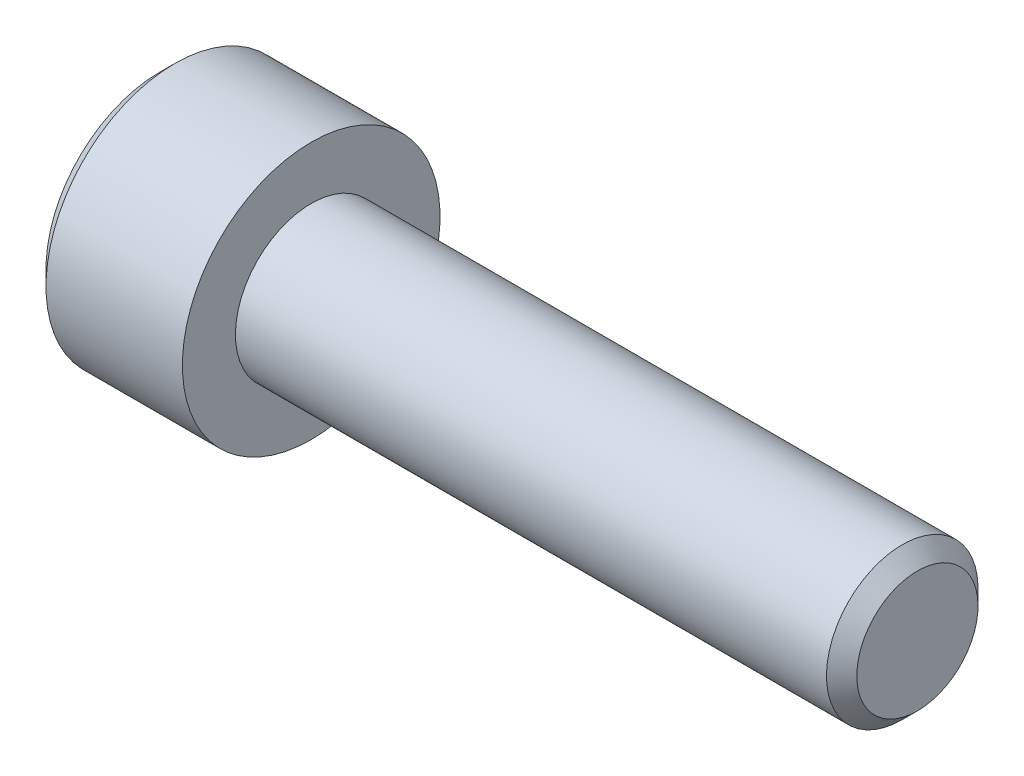
ISO-10303-21;
HEADER;
FILE_DESCRIPTION(('STEP AP214'),'2;1');
FILE_NAME('part.step','',(''),(''),'','','');
FILE_SCHEMA(('AUTOMOTIVE_DESIGN { 1 0 10303 214 1 1 1 1 }'));
ENDSEC;
DATA;
#1=APPLICATION_CONTEXT('core data for automotive mechanical design processes');
#2=APPLICATION_PROTOCOL_DEFINITION('international standard','automotive_design',2000,#1);
#3=PRODUCT_CONTEXT('',#1,'mechanical');
#4=PRODUCT('Part','Part','',(#3));
#5=PRODUCT_RELATED_PRODUCT_CATEGORY('part','',(#4));
#6=PRODUCT_DEFINITION_FORMATION('','',#4);
#7=PRODUCT_DEFINITION_CONTEXT('part definition',#1,'design');
#8=PRODUCT_DEFINITION('design','',#6,#7);
#9=PRODUCT_DEFINITION_SHAPE('','',#8);
#10=(LENGTH_UNIT() NAMED_UNIT(*) SI_UNIT(.MILLI.,.METRE.));
#11=(NAMED_UNIT(*) PLANE_ANGLE_UNIT() SI_UNIT($,.RADIAN.));
#12=(NAMED_UNIT(*) SI_UNIT($,.STERADIAN.) SOLID_ANGLE_UNIT());
#13=UNCERTAINTY_MEASURE_WITH_UNIT(LENGTH_MEASURE(1.E-05),#10,'distance_accuracy_value','');
#14=(GEOMETRIC_REPRESENTATION_CONTEXT(3) GLOBAL_UNCERTAINTY_ASSIGNED_CONTEXT((#13)) GLOBAL_UNIT_ASSIGNED_CONTEXT((#10,
#11,#12)) REPRESENTATION_CONTEXT('',''));
#15=CARTESIAN_POINT('',(0.,0.,0.));
#16=DIRECTION('',(0.,0.,1.));
#17=DIRECTION('',(1.,0.,0.));
#18=AXIS2_PLACEMENT_3D('',#15,#16,#17);
#19=CARTESIAN_POINT('',(-5.,0.,0.));
#20=DIRECTION('',(1.,0.,0.));
#21=DIRECTION('',(0.,1.,0.));
#22=AXIS2_PLACEMENT_3D('',#19,#20,#21);
#23=PLANE('',#22);
#24=CARTESIAN_POINT('',(-5.,0.,0.));
#25=DIRECTION('',(-1.,0.,0.));
#26=DIRECTION('',(0.,-1.,0.));
#27=AXIS2_PLACEMENT_3D('',#24,#25,#26);
#28=CIRCLE('',#27,3.75);
#29=CARTESIAN_POINT('',(-5.,-3.75,0.));
#30=VERTEX_POINT('',#29);
#31=EDGE_CURVE('E158',#30,#30,#28,.T.);
#32=ORIENTED_EDGE('',*,*,#31,.T.);
#33=EDGE_LOOP('',(#32));
#34=FACE_BOUND('',#33,.T.);
#35=DIRECTION('',(0.,-0.499999999999983,-0.866025403784448));
#36=VECTOR('',#35,1.);
#37=CARTESIAN_POINT('',(-5.,-1.1547005383793,2.));
#38=LINE('',#37,#36);
#39=CARTESIAN_POINT('',(-5.,-1.1547005383793,2.));
#40=VERTEX_POINT('',#39);
#41=CARTESIAN_POINT('',(-5.,-2.3094010767585,0.));
#42=VERTEX_POINT('',#41);
#43=EDGE_CURVE('E274',#40,#42,#38,.T.);
#44=ORIENTED_EDGE('',*,*,#43,.T.);
#45=DIRECTION('',(0.,0.499999999999983,-0.866025403784448));
#46=VECTOR('',#45,1.);
#47=CARTESIAN_POINT('',(-5.,-2.3094010767585,0.));
#48=LINE('',#47,#46);
#49=CARTESIAN_POINT('',(-5.,-1.1547005383793,-2.));
#50=VERTEX_POINT('',#49);
#51=EDGE_CURVE('E276',#42,#50,#48,.T.);
#52=ORIENTED_EDGE('',*,*,#51,.T.);
#53=DIRECTION('',(0.,1.,0.));
#54=VECTOR('',#53,1.);
#55=CARTESIAN_POINT('',(-5.,-1.1547005383793,-2.));
#56=LINE('',#55,#54);
#57=CARTESIAN_POINT('',(-5.,1.1547005383793,-2.));
#58=VERTEX_POINT('',#57);
#59=EDGE_CURVE('E278',#50,#58,#56,.T.);
#60=ORIENTED_EDGE('',*,*,#59,.T.);
#61=DIRECTION('',(0.,0.499999999999983,0.866025403784448));
#62=VECTOR('',#61,1.);
#63=CARTESIAN_POINT('',(-5.,1.1547005383793,-2.));
#64=LINE('',#63,#62);
#65=CARTESIAN_POINT('',(-5.,2.3094010767585,0.));
#66=VERTEX_POINT('',#65);
#67=EDGE_CURVE('E123',#58,#66,#64,.T.);
#68=ORIENTED_EDGE('',*,*,#67,.T.);
#69=DIRECTION('',(0.,-0.499999999999983,0.866025403784448));
#70=VECTOR('',#69,1.);
#71=CARTESIAN_POINT('',(-5.,2.3094010767585,0.));
#72=LINE('',#71,#70);
#73=CARTESIAN_POINT('',(-5.,1.1547005383793,2.));
#74=VERTEX_POINT('',#73);
#75=EDGE_CURVE('E271',#66,#74,#72,.T.);
#76=ORIENTED_EDGE('',*,*,#75,.T.);
#77=DIRECTION('',(0.,-1.,0.));
#78=VECTOR('',#77,1.);
#79=CARTESIAN_POINT('',(-5.,1.1547005383793,2.));
#80=LINE('',#79,#78);
#81=EDGE_CURVE('E138',#74,#40,#80,.T.);
#82=ORIENTED_EDGE('',*,*,#81,.T.);
#83=EDGE_LOOP('',(#44,#52,#60,#68,#76,#82));
#84=FACE_BOUND('',#83,.T.);
#85=ADVANCED_FACE('F39',(#34,#84),#23,.F.);
#86=CARTESIAN_POINT('',(-4.5,0.,0.));
#87=DIRECTION('',(1.,0.,0.));
#88=DIRECTION('',(0.,1.,0.));
#89=AXIS2_PLACEMENT_3D('',#86,#87,#88);
#90=CONICAL_SURFACE('',#89,4.25,0.785398163397448);
#91=ORIENTED_EDGE('',*,*,#31,.F.);
#92=EDGE_LOOP('',(#91));
#93=FACE_BOUND('',#92,.T.);
#94=CARTESIAN_POINT('',(-4.5,0.,0.));
#95=DIRECTION('',(-1.,0.,0.));
#96=DIRECTION('',(0.,-1.,0.));
#97=AXIS2_PLACEMENT_3D('',#94,#95,#96);
#98=CIRCLE('',#97,4.25);
#99=CARTESIAN_POINT('',(-4.5,-4.25,0.));
#100=VERTEX_POINT('',#99);
#101=EDGE_CURVE('E155',#100,#100,#98,.T.);
#102=ORIENTED_EDGE('',*,*,#101,.T.);
#103=EDGE_LOOP('',(#102));
#104=FACE_BOUND('',#103,.T.);
#105=ADVANCED_FACE('F178',(#93,#104),#90,.T.);
#106=CARTESIAN_POINT('',(20.,0.,0.));
#107=DIRECTION('',(-1.,0.,0.));
#108=DIRECTION('',(0.,-1.,0.));
#109=AXIS2_PLACEMENT_3D('',#106,#107,#108);
#110=CYLINDRICAL_SURFACE('',#109,4.25);
#111=ORIENTED_EDGE('',*,*,#101,.F.);
#112=EDGE_LOOP('',(#111));
#113=FACE_BOUND('',#112,.T.);
#114=CARTESIAN_POINT('',(0.,0.,0.));
#115=DIRECTION('',(-1.,0.,0.));
#116=DIRECTION('',(0.,-1.,0.));
#117=AXIS2_PLACEMENT_3D('',#114,#115,#116);
#118=CIRCLE('',#117,4.25);
#119=CARTESIAN_POINT('',(0.,-4.25,0.));
#120=VERTEX_POINT('',#119);
#121=EDGE_CURVE('E152',#120,#120,#118,.T.);
#122=ORIENTED_EDGE('',*,*,#121,.T.);
#123=EDGE_LOOP('',(#122));
#124=FACE_BOUND('',#123,.T.);
#125=ADVANCED_FACE('F183',(#113,#124),#110,.T.);
#126=CARTESIAN_POINT('',(0.,4.25,0.));
#127=DIRECTION('',(-1.,0.,0.));
#128=DIRECTION('',(0.,-1.,0.));
#129=AXIS2_PLACEMENT_3D('',#126,#127,#128);
#130=PLANE('',#129);
#131=ORIENTED_EDGE('',*,*,#121,.F.);
#132=EDGE_LOOP('',(#131));
#133=FACE_BOUND('',#132,.T.);
#134=CARTESIAN_POINT('',(0.,0.,0.));
#135=DIRECTION('',(-1.,0.,0.));
#136=DIRECTION('',(0.,-1.,0.));
#137=AXIS2_PLACEMENT_3D('',#134,#135,#136);
#138=CIRCLE('',#137,2.5);
#139=CARTESIAN_POINT('',(0.,-2.5,0.));
#140=VERTEX_POINT('',#139);
#141=EDGE_CURVE('E148',#140,#140,#138,.T.);
#142=ORIENTED_EDGE('',*,*,#141,.T.);
#143=EDGE_LOOP('',(#142));
#144=FACE_BOUND('',#143,.T.);
#145=ADVANCED_FACE('F190',(#133,#144),#130,.F.);
#146=CARTESIAN_POINT('',(20.,0.,0.));
#147=DIRECTION('',(-1.,0.,0.));
#148=DIRECTION('',(0.,-1.,0.));
#149=AXIS2_PLACEMENT_3D('',#146,#147,#148);
#150=CYLINDRICAL_SURFACE('',#149,2.5);
#151=CARTESIAN_POINT('',(19.5,0.,0.));
#152=DIRECTION('',(-1.,0.,0.));
#153=DIRECTION('',(0.,-1.,0.));
#154=AXIS2_PLACEMENT_3D('',#151,#152,#153);
#155=CIRCLE('',#154,2.5);
#156=CARTESIAN_POINT('',(19.5,-2.5,0.));
#157=VERTEX_POINT('',#156);
#158=EDGE_CURVE('E47',#157,#157,#155,.T.);
#159=ORIENTED_EDGE('',*,*,#158,.T.);
#160=EDGE_LOOP('',(#159));
#161=FACE_BOUND('',#160,.T.);
#162=ORIENTED_EDGE('',*,*,#141,.F.);
#163=EDGE_LOOP('',(#162));
#164=FACE_BOUND('',#163,.T.);
#165=ADVANCED_FACE('F163',(#161,#164),#150,.T.);
#166=CARTESIAN_POINT('',(20.,2.5,0.));
#167=DIRECTION('',(-1.,0.,0.));
#168=DIRECTION('',(0.,-1.,0.));
#169=AXIS2_PLACEMENT_3D('',#166,#167,#168);
#170=PLANE('',#169);
#171=CARTESIAN_POINT('',(20.,0.,0.));
#172=DIRECTION('',(-1.,0.,0.));
#173=DIRECTION('',(0.,-1.,0.));
#174=AXIS2_PLACEMENT_3D('',#171,#172,#173);
#175=CIRCLE('',#174,1.99999999999999);
#176=CARTESIAN_POINT('',(20.,-1.99999999999999,0.));
#177=VERTEX_POINT('',#176);
#178=EDGE_CURVE('E11',#177,#177,#175,.F.);
#179=ORIENTED_EDGE('',*,*,#178,.T.);
#180=EDGE_LOOP('',(#179));
#181=FACE_BOUND('',#180,.T.);
#182=ADVANCED_FACE('F167',(#181),#170,.F.);
#183=CARTESIAN_POINT('',(19.5,0.,0.));
#184=DIRECTION('',(-1.,0.,0.));
#185=DIRECTION('',(0.,-1.,0.));
#186=AXIS2_PLACEMENT_3D('',#183,#184,#185);
#187=CONICAL_SURFACE('',#186,2.5,0.785398163397455);
#188=ORIENTED_EDGE('',*,*,#178,.F.);
#189=EDGE_LOOP('',(#188));
#190=FACE_BOUND('',#189,.T.);
#191=ORIENTED_EDGE('',*,*,#158,.F.);
#192=EDGE_LOOP('',(#191));
#193=FACE_BOUND('',#192,.T.);
#194=ADVANCED_FACE('F41',(#190,#193),#187,.T.);
#195=CARTESIAN_POINT('',(-2.5,2.3094010767585,0.));
#196=DIRECTION('',(0.,-0.866025403784448,-0.499999999999983));
#197=DIRECTION('',(0.,0.499999999999983,-0.866025403784448));
#198=AXIS2_PLACEMENT_3D('',#195,#196,#197);
#199=PLANE('',#198);
#200=DIRECTION('',(0.,-0.499999999999983,0.866025403784448));
#201=VECTOR('',#200,1.);
#202=CARTESIAN_POINT('',(-2.5,2.3094010767585,0.));
#203=LINE('',#202,#201);
#204=CARTESIAN_POINT('',(-2.5,2.3094010767585,0.));
#205=VERTEX_POINT('',#204);
#206=CARTESIAN_POINT('',(-2.5,1.73205080756891,0.999999999999976));
#207=VERTEX_POINT('',#206);
#208=EDGE_CURVE('E120',#205,#207,#203,.T.);
#209=ORIENTED_EDGE('',*,*,#208,.T.);
#210=CARTESIAN_POINT('',(-2.5,1.1547005383793,2.));
#211=VERTEX_POINT('',#210);
#212=EDGE_CURVE('E112',#207,#211,#203,.T.);
#213=ORIENTED_EDGE('',*,*,#212,.T.);
#214=DIRECTION('',(-1.,0.,0.));
#215=VECTOR('',#214,1.);
#216=CARTESIAN_POINT('',(-2.5,1.1547005383793,2.));
#217=LINE('',#216,#215);
#218=EDGE_CURVE('E117',#211,#74,#217,.T.);
#219=ORIENTED_EDGE('',*,*,#218,.T.);
#220=ORIENTED_EDGE('',*,*,#75,.F.);
#221=DIRECTION('',(-1.,0.,0.));
#222=VECTOR('',#221,1.);
#223=CARTESIAN_POINT('',(-2.5,2.3094010767585,0.));
#224=LINE('',#223,#222);
#225=EDGE_CURVE('E255',#205,#66,#224,.T.);
#226=ORIENTED_EDGE('',*,*,#225,.F.);
#227=EDGE_LOOP('',(#209,#213,#219,#220,#226));
#228=FACE_BOUND('',#227,.T.);
#229=ADVANCED_FACE('F114',(#228),#199,.T.);
#230=CARTESIAN_POINT('',(-2.5,1.1547005383793,2.));
#231=DIRECTION('',(0.,0.,-1.));
#232=DIRECTION('',(-1.,0.,0.));
#233=AXIS2_PLACEMENT_3D('',#230,#231,#232);
#234=PLANE('',#233);
#235=DIRECTION('',(0.,-1.,0.));
#236=VECTOR('',#235,1.);
#237=CARTESIAN_POINT('',(-2.5,1.1547005383793,2.));
#238=LINE('',#237,#236);
#239=CARTESIAN_POINT('',(-2.5,0.,2.));
#240=VERTEX_POINT('',#239);
#241=EDGE_CURVE('E126',#211,#240,#238,.T.);
#242=ORIENTED_EDGE('',*,*,#241,.T.);
#243=CARTESIAN_POINT('',(-2.5,-1.1547005383793,2.));
#244=VERTEX_POINT('',#243);
#245=EDGE_CURVE('E133',#240,#244,#238,.T.);
#246=ORIENTED_EDGE('',*,*,#245,.T.);
#247=DIRECTION('',(-1.,0.,0.));
#248=VECTOR('',#247,1.);
#249=CARTESIAN_POINT('',(-2.5,-1.1547005383793,2.));
#250=LINE('',#249,#248);
#251=EDGE_CURVE('E140',#244,#40,#250,.T.);
#252=ORIENTED_EDGE('',*,*,#251,.T.);
#253=ORIENTED_EDGE('',*,*,#81,.F.);
#254=ORIENTED_EDGE('',*,*,#218,.F.);
#255=EDGE_LOOP('',(#242,#246,#252,#253,#254));
#256=FACE_BOUND('',#255,.T.);
#257=ADVANCED_FACE('F136',(#256),#234,.T.);
#258=CARTESIAN_POINT('',(-2.5,-1.1547005383793,2.));
#259=DIRECTION('',(0.,0.866025403784448,-0.499999999999983));
#260=DIRECTION('',(0.,0.499999999999983,0.866025403784448));
#261=AXIS2_PLACEMENT_3D('',#258,#259,#260);
#262=PLANE('',#261);
#263=DIRECTION('',(0.,-0.499999999999983,-0.866025403784448));
#264=VECTOR('',#263,1.);
#265=CARTESIAN_POINT('',(-2.5,-1.1547005383793,2.));
#266=LINE('',#265,#264);
#267=CARTESIAN_POINT('',(-2.5,-1.73205080756891,0.999999999999976));
#268=VERTEX_POINT('',#267);
#269=EDGE_CURVE('E262',#244,#268,#266,.T.);
#270=ORIENTED_EDGE('',*,*,#269,.T.);
#271=CARTESIAN_POINT('',(-2.5,-2.3094010767585,0.));
#272=VERTEX_POINT('',#271);
#273=EDGE_CURVE('E132',#268,#272,#266,.T.);
#274=ORIENTED_EDGE('',*,*,#273,.T.);
#275=DIRECTION('',(-1.,0.,0.));
#276=VECTOR('',#275,1.);
#277=CARTESIAN_POINT('',(-2.5,-2.3094010767585,0.));
#278=LINE('',#277,#276);
#279=EDGE_CURVE('E144',#272,#42,#278,.T.);
#280=ORIENTED_EDGE('',*,*,#279,.T.);
#281=ORIENTED_EDGE('',*,*,#43,.F.);
#282=ORIENTED_EDGE('',*,*,#251,.F.);
#283=EDGE_LOOP('',(#270,#274,#280,#281,#282));
#284=FACE_BOUND('',#283,.T.);
#285=ADVANCED_FACE('F204',(#284),#262,.T.);
#286=CARTESIAN_POINT('',(-2.5,-2.3094010767585,0.));
#287=DIRECTION('',(0.,0.866025403784448,0.499999999999983));
#288=DIRECTION('',(0.,-0.499999999999983,0.866025403784448));
#289=AXIS2_PLACEMENT_3D('',#286,#287,#288);
#290=PLANE('',#289);
#291=DIRECTION('',(0.,0.499999999999983,-0.866025403784448));
#292=VECTOR('',#291,1.);
#293=CARTESIAN_POINT('',(-2.5,-2.3094010767585,0.));
#294=LINE('',#293,#292);
#295=CARTESIAN_POINT('',(-2.5,-1.7320508075689,-0.999999999999967));
#296=VERTEX_POINT('',#295);
#297=EDGE_CURVE('E54',#272,#296,#294,.T.);
#298=ORIENTED_EDGE('',*,*,#297,.T.);
#299=CARTESIAN_POINT('',(-2.5,-1.1547005383793,-2.));
#300=VERTEX_POINT('',#299);
#301=EDGE_CURVE('E267',#296,#300,#294,.T.);
#302=ORIENTED_EDGE('',*,*,#301,.T.);
#303=DIRECTION('',(-1.,0.,0.));
#304=VECTOR('',#303,1.);
#305=CARTESIAN_POINT('',(-2.5,-1.1547005383793,-2.));
#306=LINE('',#305,#304);
#307=EDGE_CURVE('E283',#300,#50,#306,.T.);
#308=ORIENTED_EDGE('',*,*,#307,.T.);
#309=ORIENTED_EDGE('',*,*,#51,.F.);
#310=ORIENTED_EDGE('',*,*,#279,.F.);
#311=EDGE_LOOP('',(#298,#302,#308,#309,#310));
#312=FACE_BOUND('',#311,.T.);
#313=ADVANCED_FACE('F207',(#312),#290,.T.);
#314=CARTESIAN_POINT('',(-2.5,-1.1547005383793,-2.));
#315=DIRECTION('',(0.,0.,1.));
#316=DIRECTION('',(1.,0.,0.));
#317=AXIS2_PLACEMENT_3D('',#314,#315,#316);
#318=PLANE('',#317);
#319=DIRECTION('',(0.,1.,0.));
#320=VECTOR('',#319,1.);
#321=CARTESIAN_POINT('',(-2.5,-1.1547005383793,-2.));
#322=LINE('',#321,#320);
#323=CARTESIAN_POINT('',(-2.5,0.,-2.));
#324=VERTEX_POINT('',#323);
#325=EDGE_CURVE('E249',#300,#324,#322,.T.);
#326=ORIENTED_EDGE('',*,*,#325,.T.);
#327=CARTESIAN_POINT('',(-2.5,1.1547005383793,-2.));
#328=VERTEX_POINT('',#327);
#329=EDGE_CURVE('E242',#324,#328,#322,.T.);
#330=ORIENTED_EDGE('',*,*,#329,.T.);
#331=DIRECTION('',(-1.,0.,0.));
#332=VECTOR('',#331,1.);
#333=CARTESIAN_POINT('',(-2.5,1.1547005383793,-2.));
#334=LINE('',#333,#332);
#335=EDGE_CURVE('E254',#328,#58,#334,.T.);
#336=ORIENTED_EDGE('',*,*,#335,.T.);
#337=ORIENTED_EDGE('',*,*,#59,.F.);
#338=ORIENTED_EDGE('',*,*,#307,.F.);
#339=EDGE_LOOP('',(#326,#330,#336,#337,#338));
#340=FACE_BOUND('',#339,.T.);
#341=ADVANCED_FACE('F211',(#340),#318,.T.);
#342=CARTESIAN_POINT('',(-2.5,1.1547005383793,-2.));
#343=DIRECTION('',(0.,-0.866025403784448,0.499999999999983));
#344=DIRECTION('',(0.,-0.499999999999983,-0.866025403784448));
#345=AXIS2_PLACEMENT_3D('',#342,#343,#344);
#346=PLANE('',#345);
#347=DIRECTION('',(0.,0.499999999999983,0.866025403784448));
#348=VECTOR('',#347,1.);
#349=CARTESIAN_POINT('',(-2.5,1.1547005383793,-2.));
#350=LINE('',#349,#348);
#351=CARTESIAN_POINT('',(-2.5,1.73205080756891,-0.999999999999976));
#352=VERTEX_POINT('',#351);
#353=EDGE_CURVE('E241',#328,#352,#350,.T.);
#354=ORIENTED_EDGE('',*,*,#353,.T.);
#355=EDGE_CURVE('E247',#352,#205,#350,.T.);
#356=ORIENTED_EDGE('',*,*,#355,.T.);
#357=ORIENTED_EDGE('',*,*,#225,.T.);
#358=ORIENTED_EDGE('',*,*,#67,.F.);
#359=ORIENTED_EDGE('',*,*,#335,.F.);
#360=EDGE_LOOP('',(#354,#356,#357,#358,#359));
#361=FACE_BOUND('',#360,.T.);
#362=ADVANCED_FACE('F214',(#361),#346,.T.);
#363=CARTESIAN_POINT('',(-2.5,1.1547005383793,2.));
#364=DIRECTION('',(1.,0.,0.));
#365=DIRECTION('',(0.,0.,-1.));
#366=AXIS2_PLACEMENT_3D('',#363,#364,#365);
#367=PLANE('',#366);
#368=CARTESIAN_POINT('',(-2.5,0.,0.));
#369=DIRECTION('',(-1.,0.,0.));
#370=DIRECTION('',(0.,0.,1.));
#371=AXIS2_PLACEMENT_3D('',#368,#369,#370);
#372=CIRCLE('',#371,2.);
#373=EDGE_CURVE('E238',#352,#324,#372,.T.);
#374=ORIENTED_EDGE('',*,*,#373,.F.);
#375=ORIENTED_EDGE('',*,*,#353,.F.);
#376=ORIENTED_EDGE('',*,*,#329,.F.);
#377=EDGE_LOOP('',(#374,#375,#376));
#378=FACE_BOUND('',#377,.T.);
#379=ADVANCED_FACE('F218',(#378),#367,.F.);
#380=EDGE_CURVE('E149',#207,#352,#372,.T.);
#381=ORIENTED_EDGE('',*,*,#380,.F.);
#382=ORIENTED_EDGE('',*,*,#208,.F.);
#383=ORIENTED_EDGE('',*,*,#355,.F.);
#384=EDGE_LOOP('',(#381,#382,#383));
#385=FACE_BOUND('',#384,.T.);
#386=ADVANCED_FACE('F229',(#385),#367,.F.);
#387=EDGE_CURVE('E128',#240,#207,#372,.T.);
#388=ORIENTED_EDGE('',*,*,#387,.F.);
#389=ORIENTED_EDGE('',*,*,#241,.F.);
#390=ORIENTED_EDGE('',*,*,#212,.F.);
#391=EDGE_LOOP('',(#388,#389,#390));
#392=FACE_BOUND('',#391,.T.);
#393=ADVANCED_FACE('F127',(#392),#367,.F.);
#394=EDGE_CURVE('E139',#268,#240,#372,.T.);
#395=ORIENTED_EDGE('',*,*,#394,.F.);
#396=ORIENTED_EDGE('',*,*,#269,.F.);
#397=ORIENTED_EDGE('',*,*,#245,.F.);
#398=EDGE_LOOP('',(#395,#396,#397));
#399=FACE_BOUND('',#398,.T.);
#400=ADVANCED_FACE('F226',(#399),#367,.F.);
#401=EDGE_CURVE('E142',#296,#268,#372,.T.);
#402=ORIENTED_EDGE('',*,*,#401,.F.);
#403=ORIENTED_EDGE('',*,*,#297,.F.);
#404=ORIENTED_EDGE('',*,*,#273,.F.);
#405=EDGE_LOOP('',(#402,#403,#404));
#406=FACE_BOUND('',#405,.T.);
#407=ADVANCED_FACE('F221',(#406),#367,.F.);
#408=EDGE_CURVE('E246',#324,#296,#372,.T.);
#409=ORIENTED_EDGE('',*,*,#408,.F.);
#410=ORIENTED_EDGE('',*,*,#325,.F.);
#411=ORIENTED_EDGE('',*,*,#301,.F.);
#412=EDGE_LOOP('',(#409,#410,#411));
#413=FACE_BOUND('',#412,.T.);
#414=ADVANCED_FACE('F199',(#413),#367,.F.);
#415=CARTESIAN_POINT('',(-1.9641016151378,0.,0.));
#416=DIRECTION('',(-1.,0.,0.));
#417=DIRECTION('',(0.,0.,1.));
#418=AXIS2_PLACEMENT_3D('',#415,#416,#417);
#419=CONICAL_SURFACE('',#418,0.,1.30899693899577);
#420=ORIENTED_EDGE('',*,*,#387,.T.);
#421=ORIENTED_EDGE('',*,*,#380,.T.);
#422=ORIENTED_EDGE('',*,*,#373,.T.);
#423=ORIENTED_EDGE('',*,*,#408,.T.);
#424=ORIENTED_EDGE('',*,*,#401,.T.);
#425=ORIENTED_EDGE('',*,*,#394,.T.);
#426=EDGE_LOOP('',(#420,#421,#422,#423,#424,#425));
#427=FACE_BOUND('',#426,.T.);
#428=CARTESIAN_POINT('',(-1.9641016151378,0.,0.));
#429=VERTEX_POINT('',#428);
#430=VERTEX_LOOP('',#429);
#431=FACE_BOUND('',#430,.T.);
#432=ADVANCED_FACE('F197',(#427,#431),#419,.F.);
#433=CLOSED_SHELL('',(#85,#105,#125,#145,#165,#182,#194,#229,#257,#285,#313,#341,#362,#379,#386,
#393,#400,#407,#414,#432));
#434=MANIFOLD_SOLID_BREP('B2',#433);
#435=ADVANCED_BREP_SHAPE_REPRESENTATION('',(#18,#434),#14);
#436=SHAPE_DEFINITION_REPRESENTATION(#9,#435);
ENDSEC;
END-ISO-10303-21;
